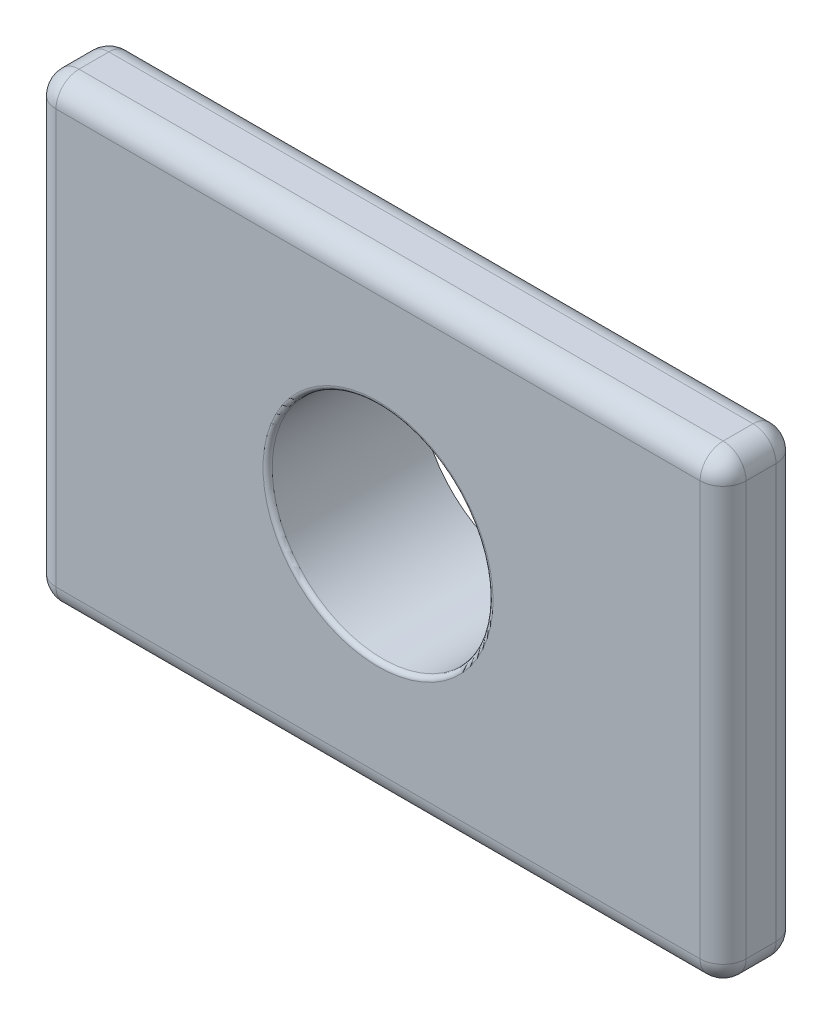
ISO-10303-21;
HEADER;
FILE_DESCRIPTION(('STEP AP214'),'2;1');
FILE_NAME('part.step','',(''),(''),'','','');
FILE_SCHEMA(('AUTOMOTIVE_DESIGN { 1 0 10303 214 1 1 1 1 }'));
ENDSEC;
DATA;
#1=APPLICATION_CONTEXT('core data for automotive mechanical design processes');
#2=APPLICATION_PROTOCOL_DEFINITION('international standard','automotive_design',2000,#1);
#3=PRODUCT_CONTEXT('',#1,'mechanical');
#4=PRODUCT('Part','Part','',(#3));
#5=PRODUCT_RELATED_PRODUCT_CATEGORY('part','',(#4));
#6=PRODUCT_DEFINITION_FORMATION('','',#4);
#7=PRODUCT_DEFINITION_CONTEXT('part definition',#1,'design');
#8=PRODUCT_DEFINITION('design','',#6,#7);
#9=PRODUCT_DEFINITION_SHAPE('','',#8);
#10=(LENGTH_UNIT() NAMED_UNIT(*) SI_UNIT(.MILLI.,.METRE.));
#11=(NAMED_UNIT(*) PLANE_ANGLE_UNIT() SI_UNIT($,.RADIAN.));
#12=(NAMED_UNIT(*) SI_UNIT($,.STERADIAN.) SOLID_ANGLE_UNIT());
#13=UNCERTAINTY_MEASURE_WITH_UNIT(LENGTH_MEASURE(1.E-05),#10,'distance_accuracy_value','');
#14=(GEOMETRIC_REPRESENTATION_CONTEXT(3) GLOBAL_UNCERTAINTY_ASSIGNED_CONTEXT((#13)) GLOBAL_UNIT_ASSIGNED_CONTEXT((#10,
#11,#12)) REPRESENTATION_CONTEXT('',''));
#15=CARTESIAN_POINT('',(0.,0.,0.));
#16=DIRECTION('',(0.,0.,1.));
#17=DIRECTION('',(1.,0.,0.));
#18=AXIS2_PLACEMENT_3D('',#15,#16,#17);
#19=CARTESIAN_POINT('',(0.,0.,0.));
#20=DIRECTION('',(0.,0.,1.));
#21=DIRECTION('',(1.,0.,0.));
#22=AXIS2_PLACEMENT_3D('',#19,#20,#21);
#23=PLANE('',#22);
#24=DIRECTION('',(0.,1.,0.));
#25=VECTOR('',#24,1.);
#26=CARTESIAN_POINT('',(14.5,0.,0.));
#27=LINE('',#26,#25);
#28=CARTESIAN_POINT('',(14.5,9.498,0.));
#29=VERTEX_POINT('',#28);
#30=CARTESIAN_POINT('',(14.5,0.5,0.));
#31=VERTEX_POINT('',#30);
#32=EDGE_CURVE('E333',#29,#31,#27,.F.);
#33=ORIENTED_EDGE('',*,*,#32,.T.);
#34=DIRECTION('',(1.,0.,0.));
#35=VECTOR('',#34,1.);
#36=CARTESIAN_POINT('',(0.,0.5,0.));
#37=LINE('',#36,#35);
#38=CARTESIAN_POINT('',(0.5,0.5,0.));
#39=VERTEX_POINT('',#38);
#40=EDGE_CURVE('E178',#31,#39,#37,.F.);
#41=ORIENTED_EDGE('',*,*,#40,.T.);
#42=DIRECTION('',(0.,1.,0.));
#43=VECTOR('',#42,1.);
#44=CARTESIAN_POINT('',(0.5,9.498,0.));
#45=LINE('',#44,#43);
#46=CARTESIAN_POINT('',(0.5,9.498,0.));
#47=VERTEX_POINT('',#46);
#48=EDGE_CURVE('E70',#39,#47,#45,.T.);
#49=ORIENTED_EDGE('',*,*,#48,.T.);
#50=DIRECTION('',(1.,0.,0.));
#51=VECTOR('',#50,1.);
#52=CARTESIAN_POINT('',(14.5,9.498,0.));
#53=LINE('',#52,#51);
#54=EDGE_CURVE('E335',#47,#29,#53,.T.);
#55=ORIENTED_EDGE('',*,*,#54,.T.);
#56=EDGE_LOOP('',(#33,#41,#49,#55));
#57=FACE_BOUND('',#56,.T.);
#58=CARTESIAN_POINT('',(7.5,4.999,0.));
#59=DIRECTION('',(0.,0.,1.));
#60=DIRECTION('',(1.,0.,0.));
#61=AXIS2_PLACEMENT_3D('',#58,#59,#60);
#62=CIRCLE('',#61,2.7);
#63=CARTESIAN_POINT('',(10.2,4.999,0.));
#64=VERTEX_POINT('',#63);
#65=EDGE_CURVE('E272',#64,#64,#62,.T.);
#66=ORIENTED_EDGE('',*,*,#65,.T.);
#67=EDGE_LOOP('',(#66));
#68=FACE_BOUND('',#67,.T.);
#69=ADVANCED_FACE('F40',(#57,#68),#23,.F.);
#70=CARTESIAN_POINT('',(0.,0.,1.65));
#71=DIRECTION('',(0.,1.,0.));
#72=DIRECTION('',(0.,0.,1.));
#73=AXIS2_PLACEMENT_3D('',#70,#71,#72);
#74=PLANE('',#73);
#75=DIRECTION('',(0.,0.,-1.));
#76=VECTOR('',#75,1.);
#77=CARTESIAN_POINT('',(14.5,0.,1.65));
#78=LINE('',#77,#76);
#79=CARTESIAN_POINT('',(14.5,0.,0.5));
#80=VERTEX_POINT('',#79);
#81=CARTESIAN_POINT('',(14.5,0.,1.15));
#82=VERTEX_POINT('',#81);
#83=EDGE_CURVE('E148',#80,#82,#78,.F.);
#84=ORIENTED_EDGE('',*,*,#83,.T.);
#85=DIRECTION('',(1.,0.,0.));
#86=VECTOR('',#85,1.);
#87=CARTESIAN_POINT('',(0.5,0.,1.15));
#88=LINE('',#87,#86);
#89=CARTESIAN_POINT('',(0.5,0.,1.15));
#90=VERTEX_POINT('',#89);
#91=EDGE_CURVE('E153',#82,#90,#88,.F.);
#92=ORIENTED_EDGE('',*,*,#91,.T.);
#93=DIRECTION('',(0.,0.,-1.));
#94=VECTOR('',#93,1.);
#95=CARTESIAN_POINT('',(0.5,0.,0.));
#96=LINE('',#95,#94);
#97=CARTESIAN_POINT('',(0.5,0.,0.5));
#98=VERTEX_POINT('',#97);
#99=EDGE_CURVE('E150',#90,#98,#96,.T.);
#100=ORIENTED_EDGE('',*,*,#99,.T.);
#101=DIRECTION('',(1.,0.,0.));
#102=VECTOR('',#101,1.);
#103=CARTESIAN_POINT('',(0.,0.,0.5));
#104=LINE('',#103,#102);
#105=EDGE_CURVE('E145',#98,#80,#104,.T.);
#106=ORIENTED_EDGE('',*,*,#105,.T.);
#107=EDGE_LOOP('',(#84,#92,#100,#106));
#108=FACE_BOUND('',#107,.T.);
#109=ADVANCED_FACE('F147',(#108),#74,.F.);
#110=CARTESIAN_POINT('',(15.,0.,1.65));
#111=DIRECTION('',(-1.,0.,0.));
#112=DIRECTION('',(0.,0.,1.));
#113=AXIS2_PLACEMENT_3D('',#110,#111,#112);
#114=PLANE('',#113);
#115=DIRECTION('',(0.,0.,-1.));
#116=VECTOR('',#115,1.);
#117=CARTESIAN_POINT('',(15.,9.498,1.65));
#118=LINE('',#117,#116);
#119=CARTESIAN_POINT('',(15.,9.498,0.5));
#120=VERTEX_POINT('',#119);
#121=CARTESIAN_POINT('',(15.,9.498,1.15));
#122=VERTEX_POINT('',#121);
#123=EDGE_CURVE('E284',#120,#122,#118,.F.);
#124=ORIENTED_EDGE('',*,*,#123,.T.);
#125=DIRECTION('',(0.,1.,0.));
#126=VECTOR('',#125,1.);
#127=CARTESIAN_POINT('',(15.,0.5,1.15));
#128=LINE('',#127,#126);
#129=CARTESIAN_POINT('',(15.,0.5,1.15));
#130=VERTEX_POINT('',#129);
#131=EDGE_CURVE('E11',#122,#130,#128,.F.);
#132=ORIENTED_EDGE('',*,*,#131,.T.);
#133=DIRECTION('',(0.,0.,-1.));
#134=VECTOR('',#133,1.);
#135=CARTESIAN_POINT('',(15.,0.5,1.65));
#136=LINE('',#135,#134);
#137=CARTESIAN_POINT('',(15.,0.5,0.5));
#138=VERTEX_POINT('',#137);
#139=EDGE_CURVE('E282',#130,#138,#136,.T.);
#140=ORIENTED_EDGE('',*,*,#139,.T.);
#141=DIRECTION('',(0.,1.,0.));
#142=VECTOR('',#141,1.);
#143=CARTESIAN_POINT('',(15.,0.,0.5));
#144=LINE('',#143,#142);
#145=EDGE_CURVE('E49',#138,#120,#144,.T.);
#146=ORIENTED_EDGE('',*,*,#145,.T.);
#147=EDGE_LOOP('',(#124,#132,#140,#146));
#148=FACE_BOUND('',#147,.T.);
#149=ADVANCED_FACE('F342',(#148),#114,.F.);
#150=CARTESIAN_POINT('',(0.,9.998,1.65));
#151=DIRECTION('',(0.,1.,0.));
#152=DIRECTION('',(0.,0.,1.));
#153=AXIS2_PLACEMENT_3D('',#150,#151,#152);
#154=PLANE('',#153);
#155=DIRECTION('',(0.,0.,-1.));
#156=VECTOR('',#155,1.);
#157=CARTESIAN_POINT('',(0.5,9.998,1.65));
#158=LINE('',#157,#156);
#159=CARTESIAN_POINT('',(0.5,9.998,0.5));
#160=VERTEX_POINT('',#159);
#161=CARTESIAN_POINT('',(0.5,9.998,1.15));
#162=VERTEX_POINT('',#161);
#163=EDGE_CURVE('E276',#160,#162,#158,.F.);
#164=ORIENTED_EDGE('',*,*,#163,.T.);
#165=DIRECTION('',(1.,0.,0.));
#166=VECTOR('',#165,1.);
#167=CARTESIAN_POINT('',(0.,9.998,1.15));
#168=LINE('',#167,#166);
#169=CARTESIAN_POINT('',(14.5,9.998,1.15));
#170=VERTEX_POINT('',#169);
#171=EDGE_CURVE('E327',#162,#170,#168,.T.);
#172=ORIENTED_EDGE('',*,*,#171,.T.);
#173=DIRECTION('',(0.,0.,-1.));
#174=VECTOR('',#173,1.);
#175=CARTESIAN_POINT('',(14.5,9.998,0.));
#176=LINE('',#175,#174);
#177=CARTESIAN_POINT('',(14.5,9.998,0.5));
#178=VERTEX_POINT('',#177);
#179=EDGE_CURVE('E279',#170,#178,#176,.T.);
#180=ORIENTED_EDGE('',*,*,#179,.T.);
#181=DIRECTION('',(1.,0.,0.));
#182=VECTOR('',#181,1.);
#183=CARTESIAN_POINT('',(0.5,9.998,0.5));
#184=LINE('',#183,#182);
#185=EDGE_CURVE('E324',#178,#160,#184,.F.);
#186=ORIENTED_EDGE('',*,*,#185,.T.);
#187=EDGE_LOOP('',(#164,#172,#180,#186));
#188=FACE_BOUND('',#187,.T.);
#189=ADVANCED_FACE('F360',(#188),#154,.T.);
#190=CARTESIAN_POINT('',(0.,0.,1.65));
#191=DIRECTION('',(-1.,0.,0.));
#192=DIRECTION('',(0.,0.,1.));
#193=AXIS2_PLACEMENT_3D('',#190,#191,#192);
#194=PLANE('',#193);
#195=DIRECTION('',(0.,0.,-1.));
#196=VECTOR('',#195,1.);
#197=CARTESIAN_POINT('',(0.,0.5,1.65));
#198=LINE('',#197,#196);
#199=CARTESIAN_POINT('',(0.,0.5,0.5));
#200=VERTEX_POINT('',#199);
#201=CARTESIAN_POINT('',(0.,0.5,1.15));
#202=VERTEX_POINT('',#201);
#203=EDGE_CURVE('E166',#200,#202,#198,.F.);
#204=ORIENTED_EDGE('',*,*,#203,.T.);
#205=DIRECTION('',(0.,1.,0.));
#206=VECTOR('',#205,1.);
#207=CARTESIAN_POINT('',(0.,0.,1.15));
#208=LINE('',#207,#206);
#209=CARTESIAN_POINT('',(0.,9.498,1.15));
#210=VERTEX_POINT('',#209);
#211=EDGE_CURVE('E317',#202,#210,#208,.T.);
#212=ORIENTED_EDGE('',*,*,#211,.T.);
#213=DIRECTION('',(0.,0.,-1.));
#214=VECTOR('',#213,1.);
#215=CARTESIAN_POINT('',(0.,9.498,1.65));
#216=LINE('',#215,#214);
#217=CARTESIAN_POINT('',(0.,9.498,0.5));
#218=VERTEX_POINT('',#217);
#219=EDGE_CURVE('E175',#210,#218,#216,.T.);
#220=ORIENTED_EDGE('',*,*,#219,.T.);
#221=DIRECTION('',(0.,1.,0.));
#222=VECTOR('',#221,1.);
#223=CARTESIAN_POINT('',(0.,0.5,0.5));
#224=LINE('',#223,#222);
#225=EDGE_CURVE('E314',#218,#200,#224,.F.);
#226=ORIENTED_EDGE('',*,*,#225,.T.);
#227=EDGE_LOOP('',(#204,#212,#220,#226));
#228=FACE_BOUND('',#227,.T.);
#229=ADVANCED_FACE('F372',(#228),#194,.T.);
#230=CARTESIAN_POINT('',(0.,0.,1.65));
#231=DIRECTION('',(0.,0.,1.));
#232=DIRECTION('',(1.,0.,0.));
#233=AXIS2_PLACEMENT_3D('',#230,#231,#232);
#234=PLANE('',#233);
#235=DIRECTION('',(0.,1.,0.));
#236=VECTOR('',#235,1.);
#237=CARTESIAN_POINT('',(0.5,0.,1.65));
#238=LINE('',#237,#236);
#239=CARTESIAN_POINT('',(0.5,9.498,1.65));
#240=VERTEX_POINT('',#239);
#241=CARTESIAN_POINT('',(0.5,0.5,1.65));
#242=VERTEX_POINT('',#241);
#243=EDGE_CURVE('E300',#240,#242,#238,.F.);
#244=ORIENTED_EDGE('',*,*,#243,.T.);
#245=DIRECTION('',(1.,0.,0.));
#246=VECTOR('',#245,1.);
#247=CARTESIAN_POINT('',(14.5,0.5,1.65));
#248=LINE('',#247,#246);
#249=CARTESIAN_POINT('',(14.5,0.5,1.65));
#250=VERTEX_POINT('',#249);
#251=EDGE_CURVE('E154',#242,#250,#248,.T.);
#252=ORIENTED_EDGE('',*,*,#251,.T.);
#253=DIRECTION('',(0.,1.,0.));
#254=VECTOR('',#253,1.);
#255=CARTESIAN_POINT('',(14.5,9.498,1.65));
#256=LINE('',#255,#254);
#257=CARTESIAN_POINT('',(14.5,9.498,1.65));
#258=VERTEX_POINT('',#257);
#259=EDGE_CURVE('E296',#250,#258,#256,.T.);
#260=ORIENTED_EDGE('',*,*,#259,.T.);
#261=DIRECTION('',(1.,0.,0.));
#262=VECTOR('',#261,1.);
#263=CARTESIAN_POINT('',(0.,9.498,1.65));
#264=LINE('',#263,#262);
#265=EDGE_CURVE('E298',#258,#240,#264,.F.);
#266=ORIENTED_EDGE('',*,*,#265,.T.);
#267=EDGE_LOOP('',(#244,#252,#260,#266));
#268=FACE_BOUND('',#267,.T.);
#269=CARTESIAN_POINT('',(7.5,4.999,1.65));
#270=DIRECTION('',(0.,0.,1.));
#271=DIRECTION('',(1.,0.,0.));
#272=AXIS2_PLACEMENT_3D('',#269,#270,#271);
#273=CIRCLE('',#272,2.5);
#274=CARTESIAN_POINT('',(10.,4.999,1.65));
#275=VERTEX_POINT('',#274);
#276=EDGE_CURVE('E256',#275,#275,#273,.F.);
#277=ORIENTED_EDGE('',*,*,#276,.T.);
#278=EDGE_LOOP('',(#277));
#279=FACE_BOUND('',#278,.T.);
#280=ADVANCED_FACE('F386',(#268,#279),#234,.T.);
#281=CARTESIAN_POINT('',(7.5,4.999,-1.65));
#282=DIRECTION('',(0.,0.,1.));
#283=DIRECTION('',(1.,0.,0.));
#284=AXIS2_PLACEMENT_3D('',#281,#282,#283);
#285=CYLINDRICAL_SURFACE('',#284,2.6);
#286=CARTESIAN_POINT('',(7.5,4.999,-1.55));
#287=DIRECTION('',(0.,0.,-1.));
#288=DIRECTION('',(-1.,0.,0.));
#289=AXIS2_PLACEMENT_3D('',#286,#287,#288);
#290=CIRCLE('',#289,2.6);
#291=CARTESIAN_POINT('',(4.9,4.999,-1.55));
#292=VERTEX_POINT('',#291);
#293=EDGE_CURVE('E268',#292,#292,#290,.F.);
#294=ORIENTED_EDGE('',*,*,#293,.T.);
#295=EDGE_LOOP('',(#294));
#296=FACE_BOUND('',#295,.T.);
#297=CARTESIAN_POINT('',(7.5,4.999,-0.1));
#298=DIRECTION('',(0.,0.,1.));
#299=DIRECTION('',(1.,0.,0.));
#300=AXIS2_PLACEMENT_3D('',#297,#298,#299);
#301=CIRCLE('',#300,2.6);
#302=CARTESIAN_POINT('',(10.1,4.999,-0.1));
#303=VERTEX_POINT('',#302);
#304=EDGE_CURVE('E264',#303,#303,#301,.F.);
#305=ORIENTED_EDGE('',*,*,#304,.T.);
#306=EDGE_LOOP('',(#305));
#307=FACE_BOUND('',#306,.T.);
#308=ADVANCED_FACE('F626',(#296,#307),#285,.T.);
#309=CARTESIAN_POINT('',(7.5,4.999,-1.65));
#310=DIRECTION('',(0.,0.,-1.));
#311=DIRECTION('',(-1.,0.,0.));
#312=AXIS2_PLACEMENT_3D('',#309,#310,#311);
#313=PLANE('',#312);
#314=CARTESIAN_POINT('',(7.5,4.999,-1.65));
#315=DIRECTION('',(0.,0.,-1.));
#316=DIRECTION('',(-1.,0.,0.));
#317=AXIS2_PLACEMENT_3D('',#314,#315,#316);
#318=CIRCLE('',#317,2.5);
#319=CARTESIAN_POINT('',(5.,4.999,-1.65));
#320=VERTEX_POINT('',#319);
#321=EDGE_CURVE('E261',#320,#320,#318,.T.);
#322=ORIENTED_EDGE('',*,*,#321,.T.);
#323=EDGE_LOOP('',(#322));
#324=FACE_BOUND('',#323,.T.);
#325=CARTESIAN_POINT('',(7.5,4.999,-1.65));
#326=DIRECTION('',(0.,0.,1.));
#327=DIRECTION('',(1.,0.,0.));
#328=AXIS2_PLACEMENT_3D('',#325,#326,#327);
#329=CIRCLE('',#328,2.4);
#330=CARTESIAN_POINT('',(9.9,4.999,-1.65));
#331=VERTEX_POINT('',#330);
#332=EDGE_CURVE('E241',#331,#331,#329,.T.);
#333=ORIENTED_EDGE('',*,*,#332,.T.);
#334=EDGE_LOOP('',(#333));
#335=FACE_BOUND('',#334,.T.);
#336=ADVANCED_FACE('F617',(#324,#335),#313,.T.);
#337=CARTESIAN_POINT('',(7.5,4.999,-1.65));
#338=DIRECTION('',(0.,0.,1.));
#339=DIRECTION('',(1.,0.,0.));
#340=AXIS2_PLACEMENT_3D('',#337,#338,#339);
#341=CYLINDRICAL_SURFACE('',#340,2.4);
#342=CARTESIAN_POINT('',(7.5,4.999,1.55));
#343=DIRECTION('',(0.,0.,1.));
#344=DIRECTION('',(1.,0.,0.));
#345=AXIS2_PLACEMENT_3D('',#342,#343,#344);
#346=CIRCLE('',#345,2.4);
#347=CARTESIAN_POINT('',(9.9,4.999,1.55));
#348=VERTEX_POINT('',#347);
#349=EDGE_CURVE('E249',#348,#348,#346,.T.);
#350=ORIENTED_EDGE('',*,*,#349,.T.);
#351=EDGE_LOOP('',(#350));
#352=FACE_BOUND('',#351,.T.);
#353=ORIENTED_EDGE('',*,*,#332,.F.);
#354=EDGE_LOOP('',(#353));
#355=FACE_BOUND('',#354,.T.);
#356=ADVANCED_FACE('F426',(#352,#355),#341,.F.);
#357=CARTESIAN_POINT('',(7.5,4.999,1.55));
#358=DIRECTION('',(0.,0.,1.));
#359=DIRECTION('',(1.,0.,0.));
#360=AXIS2_PLACEMENT_3D('',#357,#358,#359);
#361=TOROIDAL_SURFACE('',#360,2.5,0.1);
#362=ORIENTED_EDGE('',*,*,#276,.F.);
#363=EDGE_LOOP('',(#362));
#364=FACE_BOUND('',#363,.T.);
#365=ORIENTED_EDGE('',*,*,#349,.F.);
#366=EDGE_LOOP('',(#365));
#367=FACE_BOUND('',#366,.T.);
#368=ADVANCED_FACE('F422',(#364,#367),#361,.T.);
#369=CARTESIAN_POINT('',(7.5,4.999,-1.55));
#370=DIRECTION('',(0.,0.,-1.));
#371=DIRECTION('',(-1.,0.,0.));
#372=AXIS2_PLACEMENT_3D('',#369,#370,#371);
#373=TOROIDAL_SURFACE('',#372,2.5,0.1);
#374=ORIENTED_EDGE('',*,*,#293,.F.);
#375=EDGE_LOOP('',(#374));
#376=FACE_BOUND('',#375,.T.);
#377=ORIENTED_EDGE('',*,*,#321,.F.);
#378=EDGE_LOOP('',(#377));
#379=FACE_BOUND('',#378,.T.);
#380=ADVANCED_FACE('F425',(#376,#379),#373,.T.);
#381=CARTESIAN_POINT('',(7.5,4.999,-0.1));
#382=DIRECTION('',(0.,0.,1.));
#383=DIRECTION('',(1.,0.,0.));
#384=AXIS2_PLACEMENT_3D('',#381,#382,#383);
#385=TOROIDAL_SURFACE('',#384,2.7,0.1);
#386=ORIENTED_EDGE('',*,*,#65,.F.);
#387=EDGE_LOOP('',(#386));
#388=FACE_BOUND('',#387,.T.);
#389=ORIENTED_EDGE('',*,*,#304,.F.);
#390=EDGE_LOOP('',(#389));
#391=FACE_BOUND('',#390,.T.);
#392=ADVANCED_FACE('F430',(#388,#391),#385,.F.);
#393=CARTESIAN_POINT('',(14.5,9.498,1.65));
#394=DIRECTION('',(0.,0.,1.));
#395=DIRECTION('',(1.,0.,0.));
#396=AXIS2_PLACEMENT_3D('',#393,#394,#395);
#397=CYLINDRICAL_SURFACE('',#396,0.5);
#398=ORIENTED_EDGE('',*,*,#179,.F.);
#399=CARTESIAN_POINT('',(14.5,9.498,1.15));
#400=DIRECTION('',(0.,0.,1.));
#401=DIRECTION('',(1.,0.,0.));
#402=AXIS2_PLACEMENT_3D('',#399,#400,#401);
#403=CIRCLE('',#402,0.5);
#404=EDGE_CURVE('E331',#170,#122,#403,.F.);
#405=ORIENTED_EDGE('',*,*,#404,.T.);
#406=ORIENTED_EDGE('',*,*,#123,.F.);
#407=CARTESIAN_POINT('',(14.5,9.498,0.5));
#408=DIRECTION('',(0.,0.,1.));
#409=DIRECTION('',(1.,0.,0.));
#410=AXIS2_PLACEMENT_3D('',#407,#408,#409);
#411=CIRCLE('',#410,0.5);
#412=EDGE_CURVE('E329',#120,#178,#411,.T.);
#413=ORIENTED_EDGE('',*,*,#412,.T.);
#414=EDGE_LOOP('',(#398,#405,#406,#413));
#415=FACE_BOUND('',#414,.T.);
#416=ADVANCED_FACE('F348',(#415),#397,.T.);
#417=CARTESIAN_POINT('',(14.5,0.5,1.65));
#418=DIRECTION('',(0.,0.,-1.));
#419=DIRECTION('',(-1.,0.,0.));
#420=AXIS2_PLACEMENT_3D('',#417,#418,#419);
#421=CYLINDRICAL_SURFACE('',#420,0.5);
#422=ORIENTED_EDGE('',*,*,#139,.F.);
#423=CARTESIAN_POINT('',(14.5,0.5,1.15));
#424=DIRECTION('',(0.,0.,-1.));
#425=DIRECTION('',(-1.,0.,0.));
#426=AXIS2_PLACEMENT_3D('',#423,#424,#425);
#427=CIRCLE('',#426,0.5);
#428=EDGE_CURVE('E165',#130,#82,#427,.T.);
#429=ORIENTED_EDGE('',*,*,#428,.T.);
#430=ORIENTED_EDGE('',*,*,#83,.F.);
#431=CARTESIAN_POINT('',(14.5,0.5,0.5));
#432=DIRECTION('',(0.,0.,-1.));
#433=DIRECTION('',(-1.,0.,0.));
#434=AXIS2_PLACEMENT_3D('',#431,#432,#433);
#435=CIRCLE('',#434,0.5);
#436=EDGE_CURVE('E162',#80,#138,#435,.F.);
#437=ORIENTED_EDGE('',*,*,#436,.T.);
#438=EDGE_LOOP('',(#422,#429,#430,#437));
#439=FACE_BOUND('',#438,.T.);
#440=ADVANCED_FACE('F161',(#439),#421,.T.);
#441=CARTESIAN_POINT('',(0.5,9.498,1.65));
#442=DIRECTION('',(0.,0.,-1.));
#443=DIRECTION('',(-1.,0.,0.));
#444=AXIS2_PLACEMENT_3D('',#441,#442,#443);
#445=CYLINDRICAL_SURFACE('',#444,0.5);
#446=ORIENTED_EDGE('',*,*,#219,.F.);
#447=CARTESIAN_POINT('',(0.5,9.498,1.15));
#448=DIRECTION('',(0.,0.,-1.));
#449=DIRECTION('',(-1.,0.,0.));
#450=AXIS2_PLACEMENT_3D('',#447,#448,#449);
#451=CIRCLE('',#450,0.5);
#452=EDGE_CURVE('E322',#210,#162,#451,.T.);
#453=ORIENTED_EDGE('',*,*,#452,.T.);
#454=ORIENTED_EDGE('',*,*,#163,.F.);
#455=CARTESIAN_POINT('',(0.5,9.498,0.5));
#456=DIRECTION('',(0.,0.,-1.));
#457=DIRECTION('',(-1.,0.,0.));
#458=AXIS2_PLACEMENT_3D('',#455,#456,#457);
#459=CIRCLE('',#458,0.5);
#460=EDGE_CURVE('E319',#160,#218,#459,.F.);
#461=ORIENTED_EDGE('',*,*,#460,.T.);
#462=EDGE_LOOP('',(#446,#453,#454,#461));
#463=FACE_BOUND('',#462,.T.);
#464=ADVANCED_FACE('F364',(#463),#445,.T.);
#465=CARTESIAN_POINT('',(0.5,0.5,1.65));
#466=DIRECTION('',(0.,0.,1.));
#467=DIRECTION('',(1.,0.,0.));
#468=AXIS2_PLACEMENT_3D('',#465,#466,#467);
#469=CYLINDRICAL_SURFACE('',#468,0.5);
#470=ORIENTED_EDGE('',*,*,#99,.F.);
#471=CARTESIAN_POINT('',(0.5,0.5,1.15));
#472=DIRECTION('',(0.,0.,1.));
#473=DIRECTION('',(1.,0.,0.));
#474=AXIS2_PLACEMENT_3D('',#471,#472,#473);
#475=CIRCLE('',#474,0.5);
#476=EDGE_CURVE('E311',#90,#202,#475,.F.);
#477=ORIENTED_EDGE('',*,*,#476,.T.);
#478=ORIENTED_EDGE('',*,*,#203,.F.);
#479=CARTESIAN_POINT('',(0.5,0.5,0.5));
#480=DIRECTION('',(0.,0.,1.));
#481=DIRECTION('',(1.,0.,0.));
#482=AXIS2_PLACEMENT_3D('',#479,#480,#481);
#483=CIRCLE('',#482,0.5);
#484=EDGE_CURVE('E308',#200,#98,#483,.T.);
#485=ORIENTED_EDGE('',*,*,#484,.T.);
#486=EDGE_LOOP('',(#470,#477,#478,#485));
#487=FACE_BOUND('',#486,.T.);
#488=ADVANCED_FACE('F374',(#487),#469,.T.);
#489=CARTESIAN_POINT('',(0.5,9.498,1.15));
#490=DIRECTION('',(0.,0.,1.));
#491=DIRECTION('',(1.,0.,0.));
#492=AXIS2_PLACEMENT_3D('',#489,#490,#491);
#493=SPHERICAL_SURFACE('',#492,0.5);
#494=CARTESIAN_POINT('',(0.5,9.498,1.15));
#495=DIRECTION('',(1.,0.,0.));
#496=DIRECTION('',(0.,0.,-1.));
#497=AXIS2_PLACEMENT_3D('',#494,#495,#496);
#498=CIRCLE('',#497,0.5);
#499=EDGE_CURVE('E229',#162,#240,#498,.T.);
#500=ORIENTED_EDGE('',*,*,#499,.F.);
#501=ORIENTED_EDGE('',*,*,#452,.F.);
#502=CARTESIAN_POINT('',(0.5,9.498,1.15));
#503=DIRECTION('',(0.,-1.,0.));
#504=DIRECTION('',(0.,0.,-1.));
#505=AXIS2_PLACEMENT_3D('',#502,#503,#504);
#506=CIRCLE('',#505,0.5);
#507=EDGE_CURVE('E182',#240,#210,#506,.T.);
#508=ORIENTED_EDGE('',*,*,#507,.F.);
#509=EDGE_LOOP('',(#500,#501,#508));
#510=FACE_BOUND('',#509,.T.);
#511=ADVANCED_FACE('F390',(#510),#493,.T.);
#512=CARTESIAN_POINT('',(0.5,0.,1.15));
#513=DIRECTION('',(0.,1.,0.));
#514=DIRECTION('',(0.,0.,1.));
#515=AXIS2_PLACEMENT_3D('',#512,#513,#514);
#516=CYLINDRICAL_SURFACE('',#515,0.5);
#517=ORIENTED_EDGE('',*,*,#507,.T.);
#518=ORIENTED_EDGE('',*,*,#211,.F.);
#519=CARTESIAN_POINT('',(0.5,0.5,1.15));
#520=DIRECTION('',(0.,-1.,0.));
#521=DIRECTION('',(0.,0.,-1.));
#522=AXIS2_PLACEMENT_3D('',#519,#520,#521);
#523=CIRCLE('',#522,0.5);
#524=EDGE_CURVE('E226',#242,#202,#523,.T.);
#525=ORIENTED_EDGE('',*,*,#524,.F.);
#526=ORIENTED_EDGE('',*,*,#243,.F.);
#527=EDGE_LOOP('',(#517,#518,#525,#526));
#528=FACE_BOUND('',#527,.T.);
#529=ADVANCED_FACE('F388',(#528),#516,.T.);
#530=CARTESIAN_POINT('',(0.,9.498,1.15));
#531=DIRECTION('',(1.,0.,0.));
#532=DIRECTION('',(0.,0.,-1.));
#533=AXIS2_PLACEMENT_3D('',#530,#531,#532);
#534=CYLINDRICAL_SURFACE('',#533,0.5);
#535=ORIENTED_EDGE('',*,*,#499,.T.);
#536=ORIENTED_EDGE('',*,*,#265,.F.);
#537=CARTESIAN_POINT('',(14.5,9.498,1.15));
#538=DIRECTION('',(1.,0.,0.));
#539=DIRECTION('',(0.,0.,-1.));
#540=AXIS2_PLACEMENT_3D('',#537,#538,#539);
#541=CIRCLE('',#540,0.5);
#542=EDGE_CURVE('E223',#170,#258,#541,.T.);
#543=ORIENTED_EDGE('',*,*,#542,.F.);
#544=ORIENTED_EDGE('',*,*,#171,.F.);
#545=EDGE_LOOP('',(#535,#536,#543,#544));
#546=FACE_BOUND('',#545,.T.);
#547=ADVANCED_FACE('F392',(#546),#534,.T.);
#548=CARTESIAN_POINT('',(0.5,0.5,1.15));
#549=DIRECTION('',(0.,0.,1.));
#550=DIRECTION('',(1.,0.,0.));
#551=AXIS2_PLACEMENT_3D('',#548,#549,#550);
#552=SPHERICAL_SURFACE('',#551,0.5);
#553=ORIENTED_EDGE('',*,*,#524,.T.);
#554=ORIENTED_EDGE('',*,*,#476,.F.);
#555=CARTESIAN_POINT('',(0.5,0.5,1.15));
#556=DIRECTION('',(1.,0.,0.));
#557=DIRECTION('',(0.,0.,-1.));
#558=AXIS2_PLACEMENT_3D('',#555,#556,#557);
#559=CIRCLE('',#558,0.5);
#560=EDGE_CURVE('E219',#242,#90,#559,.T.);
#561=ORIENTED_EDGE('',*,*,#560,.F.);
#562=EDGE_LOOP('',(#553,#554,#561));
#563=FACE_BOUND('',#562,.T.);
#564=ADVANCED_FACE('F378',(#563),#552,.T.);
#565=CARTESIAN_POINT('',(14.5,9.498,1.15));
#566=DIRECTION('',(0.,0.,1.));
#567=DIRECTION('',(1.,0.,0.));
#568=AXIS2_PLACEMENT_3D('',#565,#566,#567);
#569=SPHERICAL_SURFACE('',#568,0.5);
#570=ORIENTED_EDGE('',*,*,#404,.F.);
#571=ORIENTED_EDGE('',*,*,#542,.T.);
#572=CARTESIAN_POINT('',(14.5,9.498,1.15));
#573=DIRECTION('',(0.,-1.,0.));
#574=DIRECTION('',(0.,0.,-1.));
#575=AXIS2_PLACEMENT_3D('',#572,#573,#574);
#576=CIRCLE('',#575,0.5);
#577=EDGE_CURVE('E213',#122,#258,#576,.T.);
#578=ORIENTED_EDGE('',*,*,#577,.F.);
#579=EDGE_LOOP('',(#570,#571,#578));
#580=FACE_BOUND('',#579,.T.);
#581=ADVANCED_FACE('F394',(#580),#569,.T.);
#582=CARTESIAN_POINT('',(0.,0.5,1.15));
#583=DIRECTION('',(-1.,0.,0.));
#584=DIRECTION('',(0.,0.,1.));
#585=AXIS2_PLACEMENT_3D('',#582,#583,#584);
#586=CYLINDRICAL_SURFACE('',#585,0.5);
#587=ORIENTED_EDGE('',*,*,#560,.T.);
#588=ORIENTED_EDGE('',*,*,#91,.F.);
#589=CARTESIAN_POINT('',(14.5,0.5,1.15));
#590=DIRECTION('',(1.,0.,0.));
#591=DIRECTION('',(0.,0.,-1.));
#592=AXIS2_PLACEMENT_3D('',#589,#590,#591);
#593=CIRCLE('',#592,0.5);
#594=EDGE_CURVE('E208',#250,#82,#593,.T.);
#595=ORIENTED_EDGE('',*,*,#594,.F.);
#596=ORIENTED_EDGE('',*,*,#251,.F.);
#597=EDGE_LOOP('',(#587,#588,#595,#596));
#598=FACE_BOUND('',#597,.T.);
#599=ADVANCED_FACE('F383',(#598),#586,.T.);
#600=CARTESIAN_POINT('',(14.5,0.,1.15));
#601=DIRECTION('',(0.,-1.,0.));
#602=DIRECTION('',(0.,0.,-1.));
#603=AXIS2_PLACEMENT_3D('',#600,#601,#602);
#604=CYLINDRICAL_SURFACE('',#603,0.5);
#605=ORIENTED_EDGE('',*,*,#577,.T.);
#606=ORIENTED_EDGE('',*,*,#259,.F.);
#607=CARTESIAN_POINT('',(14.5,0.5,1.15));
#608=DIRECTION('',(0.,-1.,0.));
#609=DIRECTION('',(0.,0.,-1.));
#610=AXIS2_PLACEMENT_3D('',#607,#608,#609);
#611=CIRCLE('',#610,0.5);
#612=EDGE_CURVE('E204',#130,#250,#611,.T.);
#613=ORIENTED_EDGE('',*,*,#612,.F.);
#614=ORIENTED_EDGE('',*,*,#131,.F.);
#615=EDGE_LOOP('',(#605,#606,#613,#614));
#616=FACE_BOUND('',#615,.T.);
#617=ADVANCED_FACE('F397',(#616),#604,.T.);
#618=CARTESIAN_POINT('',(14.5,0.5,1.15));
#619=DIRECTION('',(0.,0.,1.));
#620=DIRECTION('',(1.,0.,0.));
#621=AXIS2_PLACEMENT_3D('',#618,#619,#620);
#622=SPHERICAL_SURFACE('',#621,0.5);
#623=ORIENTED_EDGE('',*,*,#594,.T.);
#624=ORIENTED_EDGE('',*,*,#428,.F.);
#625=ORIENTED_EDGE('',*,*,#612,.T.);
#626=EDGE_LOOP('',(#623,#624,#625));
#627=FACE_BOUND('',#626,.T.);
#628=ADVANCED_FACE('F398',(#627),#622,.T.);
#629=CARTESIAN_POINT('',(0.5,9.498,0.5));
#630=DIRECTION('',(0.,0.,1.));
#631=DIRECTION('',(1.,0.,0.));
#632=AXIS2_PLACEMENT_3D('',#629,#630,#631);
#633=SPHERICAL_SURFACE('',#632,0.5);
#634=CARTESIAN_POINT('',(0.5,9.498,0.5));
#635=DIRECTION('',(0.,-1.,0.));
#636=DIRECTION('',(0.,0.,-1.));
#637=AXIS2_PLACEMENT_3D('',#634,#635,#636);
#638=CIRCLE('',#637,0.5);
#639=EDGE_CURVE('E195',#218,#47,#638,.T.);
#640=ORIENTED_EDGE('',*,*,#639,.F.);
#641=ORIENTED_EDGE('',*,*,#460,.F.);
#642=CARTESIAN_POINT('',(0.5,9.498,0.5));
#643=DIRECTION('',(1.,0.,0.));
#644=DIRECTION('',(0.,0.,-1.));
#645=AXIS2_PLACEMENT_3D('',#642,#643,#644);
#646=CIRCLE('',#645,0.5);
#647=EDGE_CURVE('E44',#47,#160,#646,.T.);
#648=ORIENTED_EDGE('',*,*,#647,.F.);
#649=EDGE_LOOP('',(#640,#641,#648));
#650=FACE_BOUND('',#649,.T.);
#651=ADVANCED_FACE('F42',(#650),#633,.T.);
#652=CARTESIAN_POINT('',(0.,9.498,0.5));
#653=DIRECTION('',(-1.,0.,0.));
#654=DIRECTION('',(0.,0.,1.));
#655=AXIS2_PLACEMENT_3D('',#652,#653,#654);
#656=CYLINDRICAL_SURFACE('',#655,0.5);
#657=ORIENTED_EDGE('',*,*,#647,.T.);
#658=ORIENTED_EDGE('',*,*,#185,.F.);
#659=CARTESIAN_POINT('',(14.5,9.498,0.5));
#660=DIRECTION('',(1.,0.,0.));
#661=DIRECTION('',(0.,0.,-1.));
#662=AXIS2_PLACEMENT_3D('',#659,#660,#661);
#663=CIRCLE('',#662,0.5);
#664=EDGE_CURVE('E193',#29,#178,#663,.T.);
#665=ORIENTED_EDGE('',*,*,#664,.F.);
#666=ORIENTED_EDGE('',*,*,#54,.F.);
#667=EDGE_LOOP('',(#657,#658,#665,#666));
#668=FACE_BOUND('',#667,.T.);
#669=ADVANCED_FACE('F357',(#668),#656,.T.);
#670=CARTESIAN_POINT('',(0.5,0.,0.5));
#671=DIRECTION('',(0.,-1.,0.));
#672=DIRECTION('',(0.,0.,-1.));
#673=AXIS2_PLACEMENT_3D('',#670,#671,#672);
#674=CYLINDRICAL_SURFACE('',#673,0.5);
#675=ORIENTED_EDGE('',*,*,#639,.T.);
#676=ORIENTED_EDGE('',*,*,#48,.F.);
#677=CARTESIAN_POINT('',(0.5,0.5,0.5));
#678=DIRECTION('',(0.,-1.,0.));
#679=DIRECTION('',(0.,0.,-1.));
#680=AXIS2_PLACEMENT_3D('',#677,#678,#679);
#681=CIRCLE('',#680,0.5);
#682=EDGE_CURVE('E190',#200,#39,#681,.T.);
#683=ORIENTED_EDGE('',*,*,#682,.F.);
#684=ORIENTED_EDGE('',*,*,#225,.F.);
#685=EDGE_LOOP('',(#675,#676,#683,#684));
#686=FACE_BOUND('',#685,.T.);
#687=ADVANCED_FACE('F368',(#686),#674,.T.);
#688=CARTESIAN_POINT('',(14.5,9.498,0.5));
#689=DIRECTION('',(0.,0.,1.));
#690=DIRECTION('',(1.,0.,0.));
#691=AXIS2_PLACEMENT_3D('',#688,#689,#690);
#692=SPHERICAL_SURFACE('',#691,0.5);
#693=ORIENTED_EDGE('',*,*,#664,.T.);
#694=ORIENTED_EDGE('',*,*,#412,.F.);
#695=CARTESIAN_POINT('',(14.5,9.498,0.5));
#696=DIRECTION('',(0.,-1.,0.));
#697=DIRECTION('',(0.,0.,-1.));
#698=AXIS2_PLACEMENT_3D('',#695,#696,#697);
#699=CIRCLE('',#698,0.5);
#700=EDGE_CURVE('E187',#29,#120,#699,.T.);
#701=ORIENTED_EDGE('',*,*,#700,.F.);
#702=EDGE_LOOP('',(#693,#694,#701));
#703=FACE_BOUND('',#702,.T.);
#704=ADVANCED_FACE('F352',(#703),#692,.T.);
#705=CARTESIAN_POINT('',(0.5,0.5,0.5));
#706=DIRECTION('',(0.,0.,1.));
#707=DIRECTION('',(1.,0.,0.));
#708=AXIS2_PLACEMENT_3D('',#705,#706,#707);
#709=SPHERICAL_SURFACE('',#708,0.5);
#710=ORIENTED_EDGE('',*,*,#484,.F.);
#711=ORIENTED_EDGE('',*,*,#682,.T.);
#712=CARTESIAN_POINT('',(0.5,0.5,0.5));
#713=DIRECTION('',(1.,0.,0.));
#714=DIRECTION('',(0.,0.,-1.));
#715=AXIS2_PLACEMENT_3D('',#712,#713,#714);
#716=CIRCLE('',#715,0.5);
#717=EDGE_CURVE('E60',#98,#39,#716,.T.);
#718=ORIENTED_EDGE('',*,*,#717,.F.);
#719=EDGE_LOOP('',(#710,#711,#718));
#720=FACE_BOUND('',#719,.T.);
#721=ADVANCED_FACE('F457',(#720),#709,.T.);
#722=CARTESIAN_POINT('',(14.5,0.,0.5));
#723=DIRECTION('',(0.,1.,0.));
#724=DIRECTION('',(0.,0.,1.));
#725=AXIS2_PLACEMENT_3D('',#722,#723,#724);
#726=CYLINDRICAL_SURFACE('',#725,0.5);
#727=ORIENTED_EDGE('',*,*,#700,.T.);
#728=ORIENTED_EDGE('',*,*,#145,.F.);
#729=CARTESIAN_POINT('',(14.5,0.5,0.5));
#730=DIRECTION('',(0.,-1.,0.));
#731=DIRECTION('',(0.,0.,-1.));
#732=AXIS2_PLACEMENT_3D('',#729,#730,#731);
#733=CIRCLE('',#732,0.5);
#734=EDGE_CURVE('E173',#31,#138,#733,.T.);
#735=ORIENTED_EDGE('',*,*,#734,.F.);
#736=ORIENTED_EDGE('',*,*,#32,.F.);
#737=EDGE_LOOP('',(#727,#728,#735,#736));
#738=FACE_BOUND('',#737,.T.);
#739=ADVANCED_FACE('F355',(#738),#726,.T.);
#740=CARTESIAN_POINT('',(0.,0.5,0.5));
#741=DIRECTION('',(1.,0.,0.));
#742=DIRECTION('',(0.,0.,-1.));
#743=AXIS2_PLACEMENT_3D('',#740,#741,#742);
#744=CYLINDRICAL_SURFACE('',#743,0.5);
#745=ORIENTED_EDGE('',*,*,#717,.T.);
#746=ORIENTED_EDGE('',*,*,#40,.F.);
#747=CARTESIAN_POINT('',(14.5,0.5,0.5));
#748=DIRECTION('',(1.,0.,0.));
#749=DIRECTION('',(0.,0.,-1.));
#750=AXIS2_PLACEMENT_3D('',#747,#748,#749);
#751=CIRCLE('',#750,0.5);
#752=EDGE_CURVE('E171',#80,#31,#751,.T.);
#753=ORIENTED_EDGE('',*,*,#752,.F.);
#754=ORIENTED_EDGE('',*,*,#105,.F.);
#755=EDGE_LOOP('',(#745,#746,#753,#754));
#756=FACE_BOUND('',#755,.T.);
#757=ADVANCED_FACE('F177',(#756),#744,.T.);
#758=CARTESIAN_POINT('',(14.5,0.5,0.5));
#759=DIRECTION('',(0.,0.,1.));
#760=DIRECTION('',(1.,0.,0.));
#761=AXIS2_PLACEMENT_3D('',#758,#759,#760);
#762=SPHERICAL_SURFACE('',#761,0.5);
#763=ORIENTED_EDGE('',*,*,#734,.T.);
#764=ORIENTED_EDGE('',*,*,#436,.F.);
#765=ORIENTED_EDGE('',*,*,#752,.T.);
#766=EDGE_LOOP('',(#763,#764,#765));
#767=FACE_BOUND('',#766,.T.);
#768=ADVANCED_FACE('F170',(#767),#762,.T.);
#769=CLOSED_SHELL('',(#69,#109,#149,#189,#229,#280,#308,#336,#356,#368,#380,#392,#416,#440,#464,
#488,#511,#529,#547,#564,#581,#599,#617,#628,#651,#669,#687,#704,#721,#739,#757,#768));
#770=MANIFOLD_SOLID_BREP('B2',#769);
#771=ADVANCED_BREP_SHAPE_REPRESENTATION('',(#18,#770),#14);
#772=SHAPE_DEFINITION_REPRESENTATION(#9,#771);
ENDSEC;
END-ISO-10303-21;
